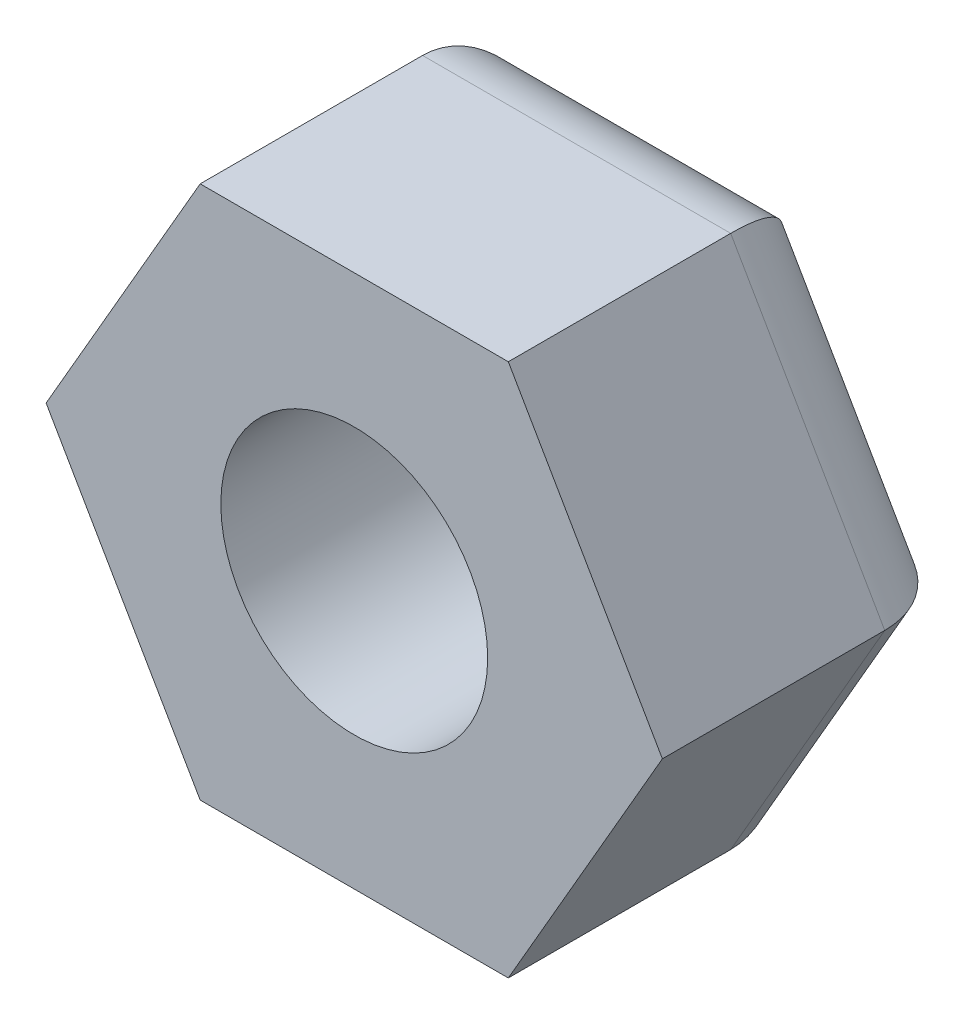
ISO-10303-21;
HEADER;
FILE_DESCRIPTION(('STEP AP214'),'2;1');
FILE_NAME('part.step','',(''),(''),'','','');
FILE_SCHEMA(('AUTOMOTIVE_DESIGN { 1 0 10303 214 1 1 1 1 }'));
ENDSEC;
DATA;
#1=APPLICATION_CONTEXT('core data for automotive mechanical design processes');
#2=APPLICATION_PROTOCOL_DEFINITION('international standard','automotive_design',2000,#1);
#3=PRODUCT_CONTEXT('',#1,'mechanical');
#4=PRODUCT('Part','Part','',(#3));
#5=PRODUCT_RELATED_PRODUCT_CATEGORY('part','',(#4));
#6=PRODUCT_DEFINITION_FORMATION('','',#4);
#7=PRODUCT_DEFINITION_CONTEXT('part definition',#1,'design');
#8=PRODUCT_DEFINITION('design','',#6,#7);
#9=PRODUCT_DEFINITION_SHAPE('','',#8);
#10=(LENGTH_UNIT() NAMED_UNIT(*) SI_UNIT(.MILLI.,.METRE.));
#11=(NAMED_UNIT(*) PLANE_ANGLE_UNIT() SI_UNIT($,.RADIAN.));
#12=(NAMED_UNIT(*) SI_UNIT($,.STERADIAN.) SOLID_ANGLE_UNIT());
#13=UNCERTAINTY_MEASURE_WITH_UNIT(LENGTH_MEASURE(1.E-05),#10,'distance_accuracy_value','');
#14=(GEOMETRIC_REPRESENTATION_CONTEXT(3) GLOBAL_UNCERTAINTY_ASSIGNED_CONTEXT((#13)) GLOBAL_UNIT_ASSIGNED_CONTEXT((#10,
#11,#12)) REPRESENTATION_CONTEXT('',''));
#15=CARTESIAN_POINT('',(0.,0.,0.));
#16=DIRECTION('',(0.,0.,1.));
#17=DIRECTION('',(1.,0.,0.));
#18=AXIS2_PLACEMENT_3D('',#15,#16,#17);
#19=CARTESIAN_POINT('',(0.,0.,35.));
#20=DIRECTION('',(0.,0.,1.));
#21=DIRECTION('',(1.,0.,0.));
#22=AXIS2_PLACEMENT_3D('',#19,#20,#21);
#23=PLANE('',#22);
#24=DIRECTION('',(-0.499999999999995,-0.866025403784442,0.));
#25=VECTOR('',#24,1.);
#26=CARTESIAN_POINT('',(-58.6974841887564,67.3364773031714,35.));
#27=LINE('',#26,#25);
#28=CARTESIAN_POINT('',(-58.6974841887564,67.3364773031714,35.));
#29=VERTEX_POINT('',#28);
#30=CARTESIAN_POINT('',(-76.0179922644449,37.3364773031715,35.));
#31=VERTEX_POINT('',#30);
#32=EDGE_CURVE('E119',#29,#31,#27,.T.);
#33=ORIENTED_EDGE('',*,*,#32,.T.);
#34=DIRECTION('',(0.500000000000001,-0.866025403784438,0.));
#35=VECTOR('',#34,1.);
#36=CARTESIAN_POINT('',(-76.0179922644449,37.3364773031715,35.));
#37=LINE('',#36,#35);
#38=CARTESIAN_POINT('',(-58.697484188756,7.3364773031714,35.));
#39=VERTEX_POINT('',#38);
#40=EDGE_CURVE('E108',#31,#39,#37,.T.);
#41=ORIENTED_EDGE('',*,*,#40,.T.);
#42=DIRECTION('',(1.,0.,0.));
#43=VECTOR('',#42,1.);
#44=CARTESIAN_POINT('',(-58.697484188756,7.3364773031714,35.));
#45=LINE('',#44,#43);
#46=CARTESIAN_POINT('',(-24.0564680373783,7.33647730317153,35.));
#47=VERTEX_POINT('',#46);
#48=EDGE_CURVE('E118',#39,#47,#45,.T.);
#49=ORIENTED_EDGE('',*,*,#48,.T.);
#50=DIRECTION('',(0.499999999999995,0.866025403784441,0.));
#51=VECTOR('',#50,1.);
#52=CARTESIAN_POINT('',(-24.0564680373783,7.33647730317153,35.));
#53=LINE('',#52,#51);
#54=CARTESIAN_POINT('',(-6.73595996168963,37.3364773031718,35.));
#55=VERTEX_POINT('',#54);
#56=EDGE_CURVE('E184',#47,#55,#53,.T.);
#57=ORIENTED_EDGE('',*,*,#56,.T.);
#58=DIRECTION('',(-0.500000000000007,0.866025403784434,0.));
#59=VECTOR('',#58,1.);
#60=CARTESIAN_POINT('',(-6.73595996168963,37.3364773031718,35.));
#61=LINE('',#60,#59);
#62=CARTESIAN_POINT('',(-24.0564680373787,67.3364773031718,35.));
#63=VERTEX_POINT('',#62);
#64=EDGE_CURVE('E186',#55,#63,#61,.T.);
#65=ORIENTED_EDGE('',*,*,#64,.T.);
#66=DIRECTION('',(-1.,0.,0.));
#67=VECTOR('',#66,1.);
#68=CARTESIAN_POINT('',(-24.0564680373787,67.3364773031718,35.));
#69=LINE('',#68,#67);
#70=EDGE_CURVE('E124',#63,#29,#69,.T.);
#71=ORIENTED_EDGE('',*,*,#70,.T.);
#72=EDGE_LOOP('',(#33,#41,#49,#57,#65,#71));
#73=FACE_BOUND('',#72,.T.);
#74=CARTESIAN_POINT('',(-41.3769761130673,37.3364773031715,35.));
#75=DIRECTION('',(0.,0.,1.));
#76=DIRECTION('',(1.,0.,0.));
#77=AXIS2_PLACEMENT_3D('',#74,#75,#76);
#78=CIRCLE('',#77,15.);
#79=CARTESIAN_POINT('',(-26.3769761130673,37.3364773031715,35.));
#80=VERTEX_POINT('',#79);
#81=EDGE_CURVE('E126',#80,#80,#78,.T.);
#82=ORIENTED_EDGE('',*,*,#81,.F.);
#83=EDGE_LOOP('',(#82));
#84=FACE_BOUND('',#83,.T.);
#85=ADVANCED_FACE('F34',(#73,#84),#23,.T.);
#86=CARTESIAN_POINT('',(0.,0.,0.));
#87=DIRECTION('',(0.,0.,1.));
#88=DIRECTION('',(1.,0.,0.));
#89=AXIS2_PLACEMENT_3D('',#86,#87,#88);
#90=PLANE('',#89);
#91=DIRECTION('',(0.499999999999995,0.866025403784442,0.));
#92=VECTOR('',#91,1.);
#93=CARTESIAN_POINT('',(-29.8793929252955,17.2508755486417,0.));
#94=LINE('',#93,#92);
#95=CARTESIAN_POINT('',(-18.2829653454822,37.3364773031717,0.));
#96=VERTEX_POINT('',#95);
#97=CARTESIAN_POINT('',(-29.8299707292746,17.3364773031715,0.));
#98=VERTEX_POINT('',#97);
#99=EDGE_CURVE('E144',#96,#98,#94,.F.);
#100=ORIENTED_EDGE('',*,*,#99,.T.);
#101=DIRECTION('',(1.,0.,0.));
#102=VECTOR('',#101,1.);
#103=CARTESIAN_POINT('',(0.,17.3364773031716,0.));
#104=LINE('',#103,#102);
#105=CARTESIAN_POINT('',(-52.9239814968598,17.3364773031714,0.));
#106=VERTEX_POINT('',#105);
#107=EDGE_CURVE('E148',#98,#106,#104,.F.);
#108=ORIENTED_EDGE('',*,*,#107,.T.);
#109=DIRECTION('',(0.500000000000001,-0.866025403784438,0.));
#110=VECTOR('',#109,1.);
#111=CARTESIAN_POINT('',(-32.1860712443054,-18.5826368970562,0.));
#112=LINE('',#111,#110);
#113=CARTESIAN_POINT('',(-64.4709868806524,37.3364773031716,0.));
#114=VERTEX_POINT('',#113);
#115=EDGE_CURVE('E146',#106,#114,#112,.F.);
#116=ORIENTED_EDGE('',*,*,#115,.T.);
#117=DIRECTION('',(-0.499999999999995,-0.866025403784442,0.));
#118=VECTOR('',#117,1.);
#119=CARTESIAN_POINT('',(-64.5204090766733,37.2508755486416,0.));
#120=LINE('',#119,#118);
#121=CARTESIAN_POINT('',(-52.9239814968601,57.3364773031715,0.));
#122=VERTEX_POINT('',#121);
#123=EDGE_CURVE('E133',#114,#122,#120,.F.);
#124=ORIENTED_EDGE('',*,*,#123,.T.);
#125=DIRECTION('',(-1.,0.,0.));
#126=VECTOR('',#125,1.);
#127=CARTESIAN_POINT('',(-5.97219493122836E-13,57.336477303172,0.));
#128=LINE('',#127,#126);
#129=CARTESIAN_POINT('',(-29.8299707292749,57.3364773031717,0.));
#130=VERTEX_POINT('',#129);
#131=EDGE_CURVE('E140',#122,#130,#128,.F.);
#132=ORIENTED_EDGE('',*,*,#131,.T.);
#133=DIRECTION('',(-0.500000000000007,0.866025403784435,0.));
#134=VECTOR('',#133,1.);
#135=CARTESIAN_POINT('',(2.45494490707255,1.41736310294407,0.));
#136=LINE('',#135,#134);
#137=EDGE_CURVE('E142',#130,#96,#136,.F.);
#138=ORIENTED_EDGE('',*,*,#137,.T.);
#139=EDGE_LOOP('',(#100,#108,#116,#124,#132,#138));
#140=FACE_BOUND('',#139,.T.);
#141=CARTESIAN_POINT('',(-41.3769761130673,37.3364773031715,0.));
#142=DIRECTION('',(0.,0.,1.));
#143=DIRECTION('',(1.,0.,0.));
#144=AXIS2_PLACEMENT_3D('',#141,#142,#143);
#145=CIRCLE('',#144,15.);
#146=CARTESIAN_POINT('',(-26.3769761130673,37.3364773031715,0.));
#147=VERTEX_POINT('',#146);
#148=EDGE_CURVE('E172',#147,#147,#145,.T.);
#149=ORIENTED_EDGE('',*,*,#148,.T.);
#150=EDGE_LOOP('',(#149));
#151=FACE_BOUND('',#150,.T.);
#152=ADVANCED_FACE('F216',(#140,#151),#90,.F.);
#153=CARTESIAN_POINT('',(-58.6974841887564,67.3364773031714,35.));
#154=DIRECTION('',(0.866025403784442,-0.499999999999995,0.));
#155=DIRECTION('',(0.499999999999995,0.866025403784442,0.));
#156=AXIS2_PLACEMENT_3D('',#153,#154,#155);
#157=PLANE('',#156);
#158=DIRECTION('',(0.,0.,-1.));
#159=VECTOR('',#158,1.);
#160=CARTESIAN_POINT('',(-58.6974841887564,67.3364773031714,35.));
#161=LINE('',#160,#159);
#162=CARTESIAN_POINT('',(-58.6974841887564,67.3364773031714,10.));
#163=VERTEX_POINT('',#162);
#164=EDGE_CURVE('E189',#29,#163,#161,.T.);
#165=ORIENTED_EDGE('',*,*,#164,.T.);
#166=DIRECTION('',(-0.499999999999995,-0.866025403784442,0.));
#167=VECTOR('',#166,1.);
#168=CARTESIAN_POINT('',(-58.6974841887564,67.3364773031714,10.));
#169=LINE('',#168,#167);
#170=CARTESIAN_POINT('',(-76.0179922644449,37.3364773031715,10.));
#171=VERTEX_POINT('',#170);
#172=EDGE_CURVE('E11',#163,#171,#169,.T.);
#173=ORIENTED_EDGE('',*,*,#172,.T.);
#174=DIRECTION('',(0.,0.,-1.));
#175=VECTOR('',#174,1.);
#176=CARTESIAN_POINT('',(-76.0179922644449,37.3364773031715,35.));
#177=LINE('',#176,#175);
#178=EDGE_CURVE('E112',#31,#171,#177,.T.);
#179=ORIENTED_EDGE('',*,*,#178,.F.);
#180=ORIENTED_EDGE('',*,*,#32,.F.);
#181=EDGE_LOOP('',(#165,#173,#179,#180));
#182=FACE_BOUND('',#181,.T.);
#183=ADVANCED_FACE('F128',(#182),#157,.F.);
#184=CARTESIAN_POINT('',(-76.0179922644449,37.3364773031715,35.));
#185=DIRECTION('',(0.866025403784438,0.500000000000001,0.));
#186=DIRECTION('',(-0.500000000000001,0.866025403784438,0.));
#187=AXIS2_PLACEMENT_3D('',#184,#185,#186);
#188=PLANE('',#187);
#189=ORIENTED_EDGE('',*,*,#178,.T.);
#190=DIRECTION('',(0.500000000000001,-0.866025403784438,0.));
#191=VECTOR('',#190,1.);
#192=CARTESIAN_POINT('',(-76.0179922644449,37.3364773031715,10.));
#193=LINE('',#192,#191);
#194=CARTESIAN_POINT('',(-58.697484188756,7.3364773031714,10.));
#195=VERTEX_POINT('',#194);
#196=EDGE_CURVE('E151',#171,#195,#193,.T.);
#197=ORIENTED_EDGE('',*,*,#196,.T.);
#198=DIRECTION('',(0.,0.,-1.));
#199=VECTOR('',#198,1.);
#200=CARTESIAN_POINT('',(-58.697484188756,7.3364773031714,35.));
#201=LINE('',#200,#199);
#202=EDGE_CURVE('E115',#39,#195,#201,.T.);
#203=ORIENTED_EDGE('',*,*,#202,.F.);
#204=ORIENTED_EDGE('',*,*,#40,.F.);
#205=EDGE_LOOP('',(#189,#197,#203,#204));
#206=FACE_BOUND('',#205,.T.);
#207=ADVANCED_FACE('F110',(#206),#188,.F.);
#208=CARTESIAN_POINT('',(-58.697484188756,7.3364773031714,35.));
#209=DIRECTION('',(0.,1.,0.));
#210=DIRECTION('',(-1.,0.,0.));
#211=AXIS2_PLACEMENT_3D('',#208,#209,#210);
#212=PLANE('',#211);
#213=ORIENTED_EDGE('',*,*,#202,.T.);
#214=DIRECTION('',(1.,0.,0.));
#215=VECTOR('',#214,1.);
#216=CARTESIAN_POINT('',(-58.697484188756,7.3364773031714,10.));
#217=LINE('',#216,#215);
#218=CARTESIAN_POINT('',(-24.0564680373783,7.33647730317153,10.));
#219=VERTEX_POINT('',#218);
#220=EDGE_CURVE('E130',#195,#219,#217,.T.);
#221=ORIENTED_EDGE('',*,*,#220,.T.);
#222=DIRECTION('',(0.,0.,-1.));
#223=VECTOR('',#222,1.);
#224=CARTESIAN_POINT('',(-24.0564680373783,7.33647730317153,35.));
#225=LINE('',#224,#223);
#226=EDGE_CURVE('E135',#47,#219,#225,.T.);
#227=ORIENTED_EDGE('',*,*,#226,.F.);
#228=ORIENTED_EDGE('',*,*,#48,.F.);
#229=EDGE_LOOP('',(#213,#221,#227,#228));
#230=FACE_BOUND('',#229,.T.);
#231=ADVANCED_FACE('F202',(#230),#212,.F.);
#232=CARTESIAN_POINT('',(-24.0564680373783,7.33647730317153,35.));
#233=DIRECTION('',(-0.866025403784442,0.499999999999995,0.));
#234=DIRECTION('',(-0.499999999999995,-0.866025403784442,0.));
#235=AXIS2_PLACEMENT_3D('',#232,#233,#234);
#236=PLANE('',#235);
#237=ORIENTED_EDGE('',*,*,#226,.T.);
#238=DIRECTION('',(0.499999999999995,0.866025403784442,0.));
#239=VECTOR('',#238,1.);
#240=CARTESIAN_POINT('',(-24.0564680373783,7.33647730317153,10.));
#241=LINE('',#240,#239);
#242=CARTESIAN_POINT('',(-6.73595996168963,37.3364773031718,10.));
#243=VERTEX_POINT('',#242);
#244=EDGE_CURVE('E153',#219,#243,#241,.T.);
#245=ORIENTED_EDGE('',*,*,#244,.T.);
#246=DIRECTION('',(0.,0.,-1.));
#247=VECTOR('',#246,1.);
#248=CARTESIAN_POINT('',(-6.73595996168963,37.3364773031718,35.));
#249=LINE('',#248,#247);
#250=EDGE_CURVE('E193',#55,#243,#249,.T.);
#251=ORIENTED_EDGE('',*,*,#250,.F.);
#252=ORIENTED_EDGE('',*,*,#56,.F.);
#253=EDGE_LOOP('',(#237,#245,#251,#252));
#254=FACE_BOUND('',#253,.T.);
#255=ADVANCED_FACE('F198',(#254),#236,.F.);
#256=CARTESIAN_POINT('',(-6.73595996168963,37.3364773031718,35.));
#257=DIRECTION('',(-0.866025403784435,-0.500000000000007,0.));
#258=DIRECTION('',(0.500000000000007,-0.866025403784435,0.));
#259=AXIS2_PLACEMENT_3D('',#256,#257,#258);
#260=PLANE('',#259);
#261=ORIENTED_EDGE('',*,*,#250,.T.);
#262=DIRECTION('',(-0.500000000000007,0.866025403784435,0.));
#263=VECTOR('',#262,1.);
#264=CARTESIAN_POINT('',(-6.73595996168963,37.3364773031718,10.));
#265=LINE('',#264,#263);
#266=CARTESIAN_POINT('',(-24.0564680373787,67.3364773031718,10.));
#267=VERTEX_POINT('',#266);
#268=EDGE_CURVE('E58',#243,#267,#265,.T.);
#269=ORIENTED_EDGE('',*,*,#268,.T.);
#270=DIRECTION('',(0.,0.,-1.));
#271=VECTOR('',#270,1.);
#272=CARTESIAN_POINT('',(-24.0564680373787,67.3364773031718,35.));
#273=LINE('',#272,#271);
#274=EDGE_CURVE('E191',#63,#267,#273,.T.);
#275=ORIENTED_EDGE('',*,*,#274,.F.);
#276=ORIENTED_EDGE('',*,*,#64,.F.);
#277=EDGE_LOOP('',(#261,#269,#275,#276));
#278=FACE_BOUND('',#277,.T.);
#279=ADVANCED_FACE('F243',(#278),#260,.F.);
#280=CARTESIAN_POINT('',(-24.0564680373787,67.3364773031718,35.));
#281=DIRECTION('',(0.,-1.,0.));
#282=DIRECTION('',(1.,0.,0.));
#283=AXIS2_PLACEMENT_3D('',#280,#281,#282);
#284=PLANE('',#283);
#285=ORIENTED_EDGE('',*,*,#274,.T.);
#286=DIRECTION('',(-1.,0.,0.));
#287=VECTOR('',#286,1.);
#288=CARTESIAN_POINT('',(-24.0564680373787,67.3364773031718,10.));
#289=LINE('',#288,#287);
#290=EDGE_CURVE('E43',#267,#163,#289,.T.);
#291=ORIENTED_EDGE('',*,*,#290,.T.);
#292=ORIENTED_EDGE('',*,*,#164,.F.);
#293=ORIENTED_EDGE('',*,*,#70,.F.);
#294=EDGE_LOOP('',(#285,#291,#292,#293));
#295=FACE_BOUND('',#294,.T.);
#296=ADVANCED_FACE('F240',(#295),#284,.F.);
#297=CARTESIAN_POINT('',(-41.3769761130673,37.3364773031715,35.));
#298=DIRECTION('',(0.,0.,-1.));
#299=DIRECTION('',(-1.,0.,0.));
#300=AXIS2_PLACEMENT_3D('',#297,#298,#299);
#301=CYLINDRICAL_SURFACE('',#300,15.);
#302=ORIENTED_EDGE('',*,*,#81,.T.);
#303=EDGE_LOOP('',(#302));
#304=FACE_BOUND('',#303,.T.);
#305=ORIENTED_EDGE('',*,*,#148,.F.);
#306=EDGE_LOOP('',(#305));
#307=FACE_BOUND('',#306,.T.);
#308=ADVANCED_FACE('F238',(#304,#307),#301,.F.);
#309=CARTESIAN_POINT('',(-24.0564680373786,57.3364773031718,10.));
#310=DIRECTION('',(-1.,0.,0.));
#311=DIRECTION('',(0.,-1.,0.));
#312=AXIS2_PLACEMENT_3D('',#309,#310,#311);
#313=CYLINDRICAL_SURFACE('',#312,10.);
#314=CARTESIAN_POINT('',(-29.8299707292749,57.3364773031717,10.));
#315=DIRECTION('',(-0.866025403784443,0.499999999999992,0.));
#316=DIRECTION('',(-0.499999999999992,-0.866025403784443,0.));
#317=AXIS2_PLACEMENT_3D('',#314,#315,#316);
#318=ELLIPSE('',#317,11.5470053837925,10.);
#319=EDGE_CURVE('E166',#130,#267,#318,.F.);
#320=ORIENTED_EDGE('',*,*,#319,.F.);
#321=ORIENTED_EDGE('',*,*,#131,.F.);
#322=CARTESIAN_POINT('',(-52.9239814968601,57.3364773031715,10.));
#323=DIRECTION('',(-0.866025403784434,-0.500000000000007,0.));
#324=DIRECTION('',(0.500000000000007,-0.866025403784435,0.));
#325=AXIS2_PLACEMENT_3D('',#322,#323,#324);
#326=ELLIPSE('',#325,11.5470053837925,10.);
#327=EDGE_CURVE('E38',#163,#122,#326,.T.);
#328=ORIENTED_EDGE('',*,*,#327,.F.);
#329=ORIENTED_EDGE('',*,*,#290,.F.);
#330=EDGE_LOOP('',(#320,#321,#328,#329));
#331=FACE_BOUND('',#330,.T.);
#332=ADVANCED_FACE('F36',(#331),#313,.T.);
#333=CARTESIAN_POINT('',(-50.037230150912,62.3364773031714,10.));
#334=DIRECTION('',(-0.499999999999995,-0.866025403784442,0.));
#335=DIRECTION('',(0.866025403784442,-0.499999999999995,0.));
#336=AXIS2_PLACEMENT_3D('',#333,#334,#335);
#337=CYLINDRICAL_SURFACE('',#336,10.);
#338=ORIENTED_EDGE('',*,*,#327,.T.);
#339=ORIENTED_EDGE('',*,*,#123,.F.);
#340=CARTESIAN_POINT('',(-64.4709868806524,37.3364773031716,10.));
#341=DIRECTION('',(0.,-1.,0.));
#342=DIRECTION('',(-1.,0.,0.));
#343=AXIS2_PLACEMENT_3D('',#340,#341,#342);
#344=ELLIPSE('',#343,11.5470053837925,10.);
#345=EDGE_CURVE('E164',#171,#114,#344,.T.);
#346=ORIENTED_EDGE('',*,*,#345,.F.);
#347=ORIENTED_EDGE('',*,*,#172,.F.);
#348=EDGE_LOOP('',(#338,#339,#346,#347));
#349=FACE_BOUND('',#348,.T.);
#350=ADVANCED_FACE('F219',(#349),#337,.T.);
#351=CARTESIAN_POINT('',(-15.396213999534,32.3364773031717,10.));
#352=DIRECTION('',(-0.500000000000007,0.866025403784435,0.));
#353=DIRECTION('',(-0.866025403784435,-0.500000000000007,0.));
#354=AXIS2_PLACEMENT_3D('',#351,#352,#353);
#355=CYLINDRICAL_SURFACE('',#354,10.);
#356=ORIENTED_EDGE('',*,*,#319,.T.);
#357=ORIENTED_EDGE('',*,*,#268,.F.);
#358=CARTESIAN_POINT('',(-18.2829653454822,37.3364773031717,10.));
#359=DIRECTION('',(0.,1.,0.));
#360=DIRECTION('',(-1.,0.,0.));
#361=AXIS2_PLACEMENT_3D('',#358,#359,#360);
#362=ELLIPSE('',#361,11.5470053837925,10.);
#363=EDGE_CURVE('E161',#96,#243,#362,.F.);
#364=ORIENTED_EDGE('',*,*,#363,.F.);
#365=ORIENTED_EDGE('',*,*,#137,.F.);
#366=EDGE_LOOP('',(#356,#357,#364,#365));
#367=FACE_BOUND('',#366,.T.);
#368=ADVANCED_FACE('F214',(#367),#355,.T.);
#369=CARTESIAN_POINT('',(-67.3577382266005,42.3364773031715,10.));
#370=DIRECTION('',(0.500000000000001,-0.866025403784438,0.));
#371=DIRECTION('',(0.866025403784438,0.500000000000001,0.));
#372=AXIS2_PLACEMENT_3D('',#369,#370,#371);
#373=CYLINDRICAL_SURFACE('',#372,10.);
#374=ORIENTED_EDGE('',*,*,#345,.T.);
#375=ORIENTED_EDGE('',*,*,#115,.F.);
#376=CARTESIAN_POINT('',(-52.9239814968598,17.3364773031714,10.));
#377=DIRECTION('',(0.86602540378444,-0.499999999999998,0.));
#378=DIRECTION('',(-0.499999999999998,-0.86602540378444,0.));
#379=AXIS2_PLACEMENT_3D('',#376,#377,#378);
#380=ELLIPSE('',#379,11.5470053837925,10.);
#381=EDGE_CURVE('E159',#195,#106,#380,.T.);
#382=ORIENTED_EDGE('',*,*,#381,.F.);
#383=ORIENTED_EDGE('',*,*,#196,.F.);
#384=EDGE_LOOP('',(#374,#375,#382,#383));
#385=FACE_BOUND('',#384,.T.);
#386=ADVANCED_FACE('F222',(#385),#373,.T.);
#387=CARTESIAN_POINT('',(-32.7167220752227,12.3364773031715,10.));
#388=DIRECTION('',(0.499999999999995,0.866025403784442,0.));
#389=DIRECTION('',(-0.866025403784442,0.499999999999995,0.));
#390=AXIS2_PLACEMENT_3D('',#387,#388,#389);
#391=CYLINDRICAL_SURFACE('',#390,10.);
#392=ORIENTED_EDGE('',*,*,#363,.T.);
#393=ORIENTED_EDGE('',*,*,#244,.F.);
#394=CARTESIAN_POINT('',(-29.8299707292746,17.3364773031715,10.));
#395=DIRECTION('',(0.866025403784436,0.500000000000004,0.));
#396=DIRECTION('',(-0.500000000000004,0.866025403784436,0.));
#397=AXIS2_PLACEMENT_3D('',#394,#395,#396);
#398=ELLIPSE('',#397,11.5470053837925,10.);
#399=EDGE_CURVE('E157',#98,#219,#398,.F.);
#400=ORIENTED_EDGE('',*,*,#399,.F.);
#401=ORIENTED_EDGE('',*,*,#99,.F.);
#402=EDGE_LOOP('',(#392,#393,#400,#401));
#403=FACE_BOUND('',#402,.T.);
#404=ADVANCED_FACE('F212',(#403),#391,.T.);
#405=CARTESIAN_POINT('',(-58.6974841887561,17.3364773031714,10.));
#406=DIRECTION('',(1.,0.,0.));
#407=DIRECTION('',(0.,1.,0.));
#408=AXIS2_PLACEMENT_3D('',#405,#406,#407);
#409=CYLINDRICAL_SURFACE('',#408,10.);
#410=ORIENTED_EDGE('',*,*,#381,.T.);
#411=ORIENTED_EDGE('',*,*,#107,.F.);
#412=ORIENTED_EDGE('',*,*,#399,.T.);
#413=ORIENTED_EDGE('',*,*,#220,.F.);
#414=EDGE_LOOP('',(#410,#411,#412,#413));
#415=FACE_BOUND('',#414,.T.);
#416=ADVANCED_FACE('F206',(#415),#409,.T.);
#417=CLOSED_SHELL('',(#85,#152,#183,#207,#231,#255,#279,#296,#308,#332,#350,#368,#386,#404,#416));
#418=MANIFOLD_SOLID_BREP('B2',#417);
#419=ADVANCED_BREP_SHAPE_REPRESENTATION('',(#18,#418),#14);
#420=SHAPE_DEFINITION_REPRESENTATION(#9,#419);
ENDSEC;
END-ISO-10303-21;
